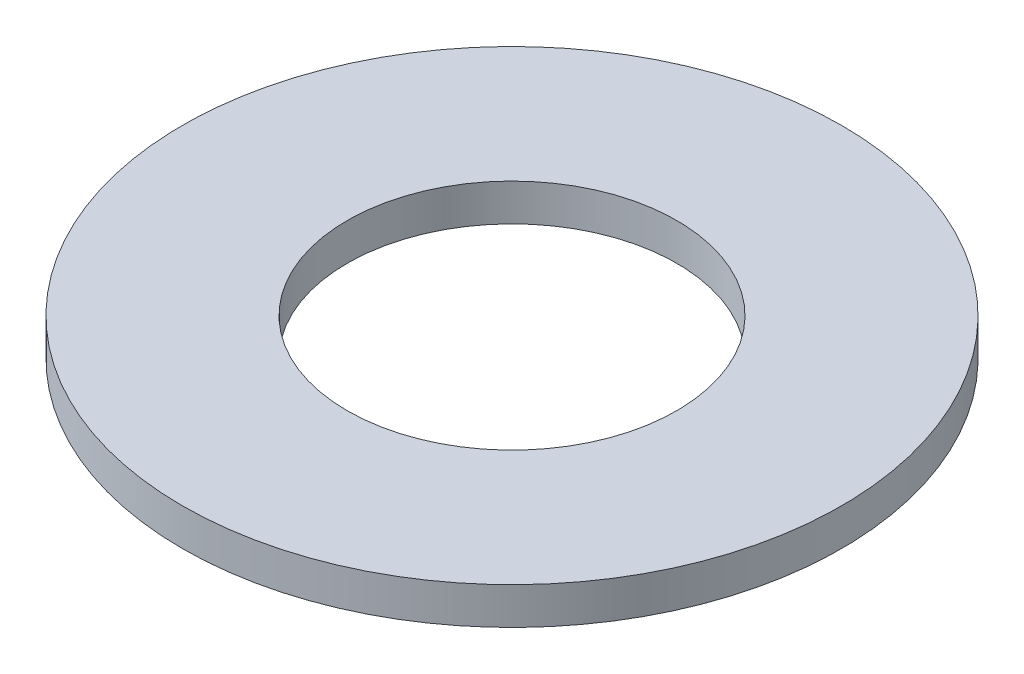
ISO-10303-21;
HEADER;
FILE_DESCRIPTION(('STEP AP214'),'2;1');
FILE_NAME('part.step','',(''),(''),'','','');
FILE_SCHEMA(('AUTOMOTIVE_DESIGN { 1 0 10303 214 1 1 1 1 }'));
ENDSEC;
DATA;
#1=APPLICATION_CONTEXT('core data for automotive mechanical design processes');
#2=APPLICATION_PROTOCOL_DEFINITION('international standard','automotive_design',2000,#1);
#3=PRODUCT_CONTEXT('',#1,'mechanical');
#4=PRODUCT('Part','Part','',(#3));
#5=PRODUCT_RELATED_PRODUCT_CATEGORY('part','',(#4));
#6=PRODUCT_DEFINITION_FORMATION('','',#4);
#7=PRODUCT_DEFINITION_CONTEXT('part definition',#1,'design');
#8=PRODUCT_DEFINITION('design','',#6,#7);
#9=PRODUCT_DEFINITION_SHAPE('','',#8);
#10=(LENGTH_UNIT() NAMED_UNIT(*) SI_UNIT(.MILLI.,.METRE.));
#11=(NAMED_UNIT(*) PLANE_ANGLE_UNIT() SI_UNIT($,.RADIAN.));
#12=(NAMED_UNIT(*) SI_UNIT($,.STERADIAN.) SOLID_ANGLE_UNIT());
#13=UNCERTAINTY_MEASURE_WITH_UNIT(LENGTH_MEASURE(1.E-05),#10,'distance_accuracy_value','');
#14=(GEOMETRIC_REPRESENTATION_CONTEXT(3) GLOBAL_UNCERTAINTY_ASSIGNED_CONTEXT((#13)) GLOBAL_UNIT_ASSIGNED_CONTEXT((#10,
#11,#12)) REPRESENTATION_CONTEXT('',''));
#15=CARTESIAN_POINT('',(0.,0.,0.));
#16=DIRECTION('',(0.,0.,1.));
#17=DIRECTION('',(1.,0.,0.));
#18=AXIS2_PLACEMENT_3D('',#15,#16,#17);
#19=CARTESIAN_POINT('',(0.,9.,0.));
#20=DIRECTION('',(0.,-1.,0.));
#21=DIRECTION('',(0.,0.,-1.));
#22=AXIS2_PLACEMENT_3D('',#19,#20,#21);
#23=CYLINDRICAL_SURFACE('',#22,80.);
#24=CARTESIAN_POINT('',(0.,9.,0.));
#25=DIRECTION('',(0.,1.,0.));
#26=DIRECTION('',(0.,0.,1.));
#27=AXIS2_PLACEMENT_3D('',#24,#25,#26);
#28=CIRCLE('',#27,80.);
#29=CARTESIAN_POINT('',(0.,9.,80.));
#30=VERTEX_POINT('',#29);
#31=EDGE_CURVE('E10',#30,#30,#28,.T.);
#32=ORIENTED_EDGE('',*,*,#31,.F.);
#33=EDGE_LOOP('',(#32));
#34=FACE_BOUND('',#33,.T.);
#35=CARTESIAN_POINT('',(0.,0.,0.));
#36=DIRECTION('',(0.,1.,0.));
#37=DIRECTION('',(0.,0.,1.));
#38=AXIS2_PLACEMENT_3D('',#35,#36,#37);
#39=CIRCLE('',#38,80.);
#40=CARTESIAN_POINT('',(0.,0.,80.));
#41=VERTEX_POINT('',#40);
#42=EDGE_CURVE('E37',#41,#41,#39,.T.);
#43=ORIENTED_EDGE('',*,*,#42,.T.);
#44=EDGE_LOOP('',(#43));
#45=FACE_BOUND('',#44,.T.);
#46=ADVANCED_FACE('F40',(#34,#45),#23,.T.);
#47=CARTESIAN_POINT('',(0.,9.,0.));
#48=DIRECTION('',(0.,1.,0.));
#49=DIRECTION('',(0.,0.,1.));
#50=AXIS2_PLACEMENT_3D('',#47,#48,#49);
#51=PLANE('',#50);
#52=CARTESIAN_POINT('',(0.,9.,0.));
#53=DIRECTION('',(0.,1.,0.));
#54=DIRECTION('',(0.,0.,1.));
#55=AXIS2_PLACEMENT_3D('',#52,#53,#54);
#56=CIRCLE('',#55,40.);
#57=CARTESIAN_POINT('',(0.,9.,40.));
#58=VERTEX_POINT('',#57);
#59=EDGE_CURVE('E50',#58,#58,#56,.T.);
#60=ORIENTED_EDGE('',*,*,#59,.F.);
#61=EDGE_LOOP('',(#60));
#62=FACE_BOUND('',#61,.T.);
#63=ORIENTED_EDGE('',*,*,#31,.T.);
#64=EDGE_LOOP('',(#63));
#65=FACE_BOUND('',#64,.T.);
#66=ADVANCED_FACE('F59',(#62,#65),#51,.T.);
#67=CARTESIAN_POINT('',(0.,0.,0.));
#68=DIRECTION('',(0.,1.,0.));
#69=DIRECTION('',(0.,0.,1.));
#70=AXIS2_PLACEMENT_3D('',#67,#68,#69);
#71=PLANE('',#70);
#72=CARTESIAN_POINT('',(0.,0.,0.));
#73=DIRECTION('',(0.,1.,0.));
#74=DIRECTION('',(0.,0.,1.));
#75=AXIS2_PLACEMENT_3D('',#72,#73,#74);
#76=CIRCLE('',#75,40.);
#77=CARTESIAN_POINT('',(0.,0.,40.));
#78=VERTEX_POINT('',#77);
#79=EDGE_CURVE('E47',#78,#78,#76,.T.);
#80=ORIENTED_EDGE('',*,*,#79,.T.);
#81=EDGE_LOOP('',(#80));
#82=FACE_BOUND('',#81,.T.);
#83=ORIENTED_EDGE('',*,*,#42,.F.);
#84=EDGE_LOOP('',(#83));
#85=FACE_BOUND('',#84,.T.);
#86=ADVANCED_FACE('F58',(#82,#85),#71,.F.);
#87=CARTESIAN_POINT('',(0.,9.,0.));
#88=DIRECTION('',(0.,-1.,0.));
#89=DIRECTION('',(0.,0.,-1.));
#90=AXIS2_PLACEMENT_3D('',#87,#88,#89);
#91=CYLINDRICAL_SURFACE('',#90,40.);
#92=ORIENTED_EDGE('',*,*,#59,.T.);
#93=EDGE_LOOP('',(#92));
#94=FACE_BOUND('',#93,.T.);
#95=ORIENTED_EDGE('',*,*,#79,.F.);
#96=EDGE_LOOP('',(#95));
#97=FACE_BOUND('',#96,.T.);
#98=ADVANCED_FACE('F54',(#94,#97),#91,.F.);
#99=CLOSED_SHELL('',(#46,#66,#86,#98));
#100=MANIFOLD_SOLID_BREP('B2',#99);
#101=ADVANCED_BREP_SHAPE_REPRESENTATION('',(#18,#100),#14);
#102=SHAPE_DEFINITION_REPRESENTATION(#9,#101);
ENDSEC;
END-ISO-10303-21;
